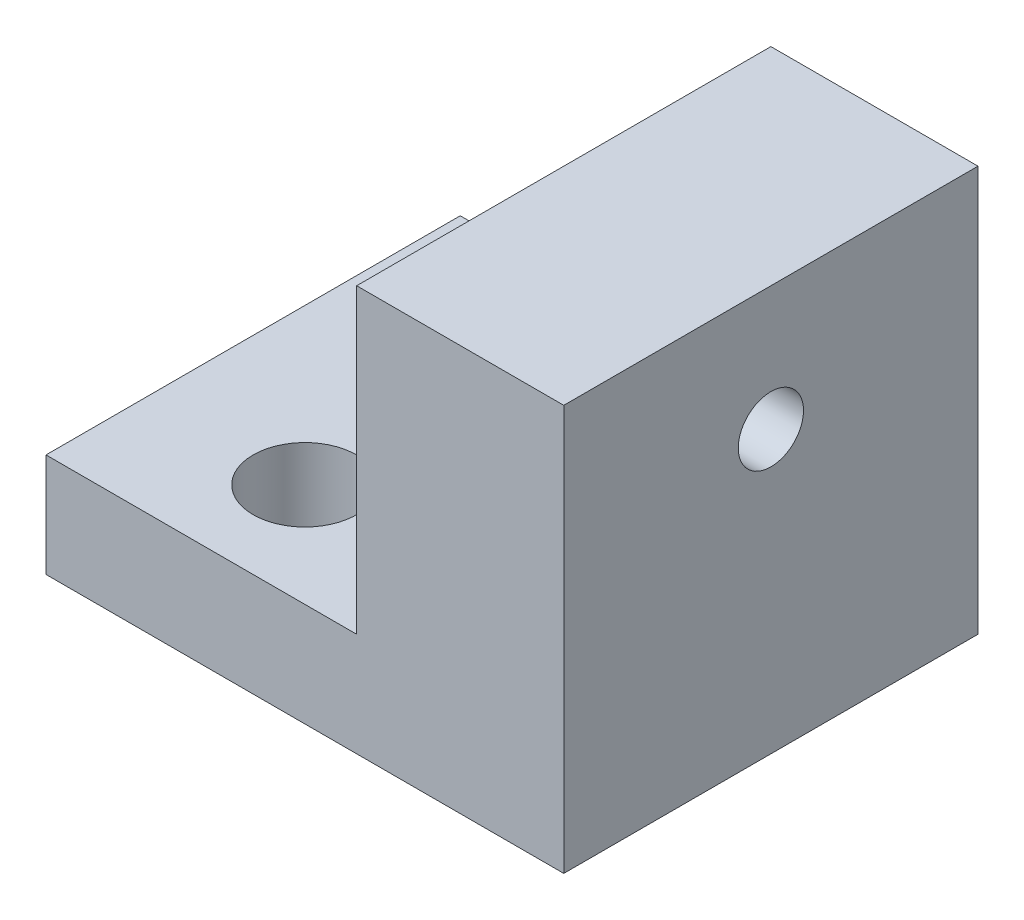
ISO-10303-21;
HEADER;
FILE_DESCRIPTION(('STEP AP214'),'2;1');
FILE_NAME('part.step','',(''),(''),'','','');
FILE_SCHEMA(('AUTOMOTIVE_DESIGN { 1 0 10303 214 1 1 1 1 }'));
ENDSEC;
DATA;
#1=APPLICATION_CONTEXT('core data for automotive mechanical design processes');
#2=APPLICATION_PROTOCOL_DEFINITION('international standard','automotive_design',2000,#1);
#3=PRODUCT_CONTEXT('',#1,'mechanical');
#4=PRODUCT('Part','Part','',(#3));
#5=PRODUCT_RELATED_PRODUCT_CATEGORY('part','',(#4));
#6=PRODUCT_DEFINITION_FORMATION('','',#4);
#7=PRODUCT_DEFINITION_CONTEXT('part definition',#1,'design');
#8=PRODUCT_DEFINITION('design','',#6,#7);
#9=PRODUCT_DEFINITION_SHAPE('','',#8);
#10=(LENGTH_UNIT() NAMED_UNIT(*) SI_UNIT(.MILLI.,.METRE.));
#11=(NAMED_UNIT(*) PLANE_ANGLE_UNIT() SI_UNIT($,.RADIAN.));
#12=(NAMED_UNIT(*) SI_UNIT($,.STERADIAN.) SOLID_ANGLE_UNIT());
#13=UNCERTAINTY_MEASURE_WITH_UNIT(LENGTH_MEASURE(1.E-05),#10,'distance_accuracy_value','');
#14=(GEOMETRIC_REPRESENTATION_CONTEXT(3) GLOBAL_UNCERTAINTY_ASSIGNED_CONTEXT((#13)) GLOBAL_UNIT_ASSIGNED_CONTEXT((#10,
#11,#12)) REPRESENTATION_CONTEXT('',''));
#15=CARTESIAN_POINT('',(0.,0.,0.));
#16=DIRECTION('',(0.,0.,1.));
#17=DIRECTION('',(1.,0.,0.));
#18=AXIS2_PLACEMENT_3D('',#15,#16,#17);
#19=CARTESIAN_POINT('',(-25.4,0.,25.4));
#20=DIRECTION('',(-1.,0.,0.));
#21=DIRECTION('',(0.,0.,1.));
#22=AXIS2_PLACEMENT_3D('',#19,#20,#21);
#23=PLANE('',#22);
#24=DIRECTION('',(0.,1.,0.));
#25=VECTOR('',#24,1.);
#26=CARTESIAN_POINT('',(-25.4,0.,0.));
#27=LINE('',#26,#25);
#28=CARTESIAN_POINT('',(-25.4,-19.05,0.));
#29=VERTEX_POINT('',#28);
#30=CARTESIAN_POINT('',(-25.4,-12.7,0.));
#31=VERTEX_POINT('',#30);
#32=EDGE_CURVE('E118',#29,#31,#27,.T.);
#33=ORIENTED_EDGE('',*,*,#32,.F.);
#34=DIRECTION('',(0.,0.,-1.));
#35=VECTOR('',#34,1.);
#36=CARTESIAN_POINT('',(-25.4,-19.05,25.4));
#37=LINE('',#36,#35);
#38=CARTESIAN_POINT('',(-25.4,-19.05,25.4));
#39=VERTEX_POINT('',#38);
#40=EDGE_CURVE('E11',#39,#29,#37,.T.);
#41=ORIENTED_EDGE('',*,*,#40,.F.);
#42=DIRECTION('',(0.,1.,0.));
#43=VECTOR('',#42,1.);
#44=CARTESIAN_POINT('',(-25.4,0.,25.4));
#45=LINE('',#44,#43);
#46=CARTESIAN_POINT('',(-25.4,-12.7,25.4));
#47=VERTEX_POINT('',#46);
#48=EDGE_CURVE('E132',#39,#47,#45,.T.);
#49=ORIENTED_EDGE('',*,*,#48,.T.);
#50=DIRECTION('',(0.,0.,-1.));
#51=VECTOR('',#50,1.);
#52=CARTESIAN_POINT('',(-25.4,-12.7,25.4));
#53=LINE('',#52,#51);
#54=EDGE_CURVE('E79',#47,#31,#53,.T.);
#55=ORIENTED_EDGE('',*,*,#54,.T.);
#56=EDGE_LOOP('',(#33,#41,#49,#55));
#57=FACE_BOUND('',#56,.T.);
#58=ADVANCED_FACE('F35',(#57),#23,.T.);
#59=CARTESIAN_POINT('',(0.,-19.05,25.4));
#60=DIRECTION('',(0.,-1.,0.));
#61=DIRECTION('',(1.,0.,0.));
#62=AXIS2_PLACEMENT_3D('',#59,#60,#61);
#63=PLANE('',#62);
#64=CARTESIAN_POINT('',(-15.875,-19.05,6.35));
#65=DIRECTION('',(0.,-1.,0.));
#66=DIRECTION('',(1.,0.,0.));
#67=AXIS2_PLACEMENT_3D('',#64,#65,#66);
#68=CIRCLE('',#67,3.175);
#69=CARTESIAN_POINT('',(-12.7,-19.05,6.35));
#70=VERTEX_POINT('',#69);
#71=EDGE_CURVE('E155',#70,#70,#68,.F.);
#72=ORIENTED_EDGE('',*,*,#71,.T.);
#73=EDGE_LOOP('',(#72));
#74=FACE_BOUND('',#73,.T.);
#75=CARTESIAN_POINT('',(-15.875,-19.05,19.05));
#76=DIRECTION('',(0.,-1.,0.));
#77=DIRECTION('',(1.,0.,0.));
#78=AXIS2_PLACEMENT_3D('',#75,#76,#77);
#79=CIRCLE('',#78,3.175);
#80=CARTESIAN_POINT('',(-12.7,-19.05,19.05));
#81=VERTEX_POINT('',#80);
#82=EDGE_CURVE('E148',#81,#81,#79,.F.);
#83=ORIENTED_EDGE('',*,*,#82,.T.);
#84=EDGE_LOOP('',(#83));
#85=FACE_BOUND('',#84,.T.);
#86=DIRECTION('',(-1.,0.,0.));
#87=VECTOR('',#86,1.);
#88=CARTESIAN_POINT('',(0.,-19.05,0.));
#89=LINE('',#88,#87);
#90=CARTESIAN_POINT('',(6.35,-19.05,0.));
#91=VERTEX_POINT('',#90);
#92=EDGE_CURVE('E121',#91,#29,#89,.T.);
#93=ORIENTED_EDGE('',*,*,#92,.F.);
#94=DIRECTION('',(0.,0.,-1.));
#95=VECTOR('',#94,1.);
#96=CARTESIAN_POINT('',(6.35,-19.05,25.4));
#97=LINE('',#96,#95);
#98=CARTESIAN_POINT('',(6.35,-19.05,25.4));
#99=VERTEX_POINT('',#98);
#100=EDGE_CURVE('E42',#99,#91,#97,.T.);
#101=ORIENTED_EDGE('',*,*,#100,.F.);
#102=DIRECTION('',(-1.,0.,0.));
#103=VECTOR('',#102,1.);
#104=CARTESIAN_POINT('',(0.,-19.05,25.4));
#105=LINE('',#104,#103);
#106=EDGE_CURVE('E114',#99,#39,#105,.T.);
#107=ORIENTED_EDGE('',*,*,#106,.T.);
#108=ORIENTED_EDGE('',*,*,#40,.T.);
#109=EDGE_LOOP('',(#93,#101,#107,#108));
#110=FACE_BOUND('',#109,.T.);
#111=ADVANCED_FACE('F142',(#74,#85,#110),#63,.T.);
#112=CARTESIAN_POINT('',(6.35,0.,25.4));
#113=DIRECTION('',(-1.,0.,0.));
#114=DIRECTION('',(0.,0.,1.));
#115=AXIS2_PLACEMENT_3D('',#112,#113,#114);
#116=PLANE('',#115);
#117=CARTESIAN_POINT('',(6.35,-1.81099996600001,12.7));
#118=DIRECTION('',(1.,0.,0.));
#119=DIRECTION('',(0.,0.,-1.));
#120=AXIS2_PLACEMENT_3D('',#117,#118,#119);
#121=CIRCLE('',#120,2.);
#122=CARTESIAN_POINT('',(6.35,-1.81099996600001,10.7));
#123=VERTEX_POINT('',#122);
#124=EDGE_CURVE('E152',#123,#123,#121,.T.);
#125=ORIENTED_EDGE('',*,*,#124,.F.);
#126=EDGE_LOOP('',(#125));
#127=FACE_BOUND('',#126,.T.);
#128=DIRECTION('',(0.,1.,0.));
#129=VECTOR('',#128,1.);
#130=CARTESIAN_POINT('',(6.35,0.,0.));
#131=LINE('',#130,#129);
#132=CARTESIAN_POINT('',(6.35,5.80900003399999,0.));
#133=VERTEX_POINT('',#132);
#134=EDGE_CURVE('E125',#91,#133,#131,.T.);
#135=ORIENTED_EDGE('',*,*,#134,.T.);
#136=DIRECTION('',(0.,0.,-1.));
#137=VECTOR('',#136,1.);
#138=CARTESIAN_POINT('',(6.35,5.80900003399999,25.4));
#139=LINE('',#138,#137);
#140=CARTESIAN_POINT('',(6.35,5.80900003399999,25.4));
#141=VERTEX_POINT('',#140);
#142=EDGE_CURVE('E49',#141,#133,#139,.T.);
#143=ORIENTED_EDGE('',*,*,#142,.F.);
#144=DIRECTION('',(0.,1.,0.));
#145=VECTOR('',#144,1.);
#146=CARTESIAN_POINT('',(6.35,0.,25.4));
#147=LINE('',#146,#145);
#148=EDGE_CURVE('E107',#99,#141,#147,.T.);
#149=ORIENTED_EDGE('',*,*,#148,.F.);
#150=ORIENTED_EDGE('',*,*,#100,.T.);
#151=EDGE_LOOP('',(#135,#143,#149,#150));
#152=FACE_BOUND('',#151,.T.);
#153=ADVANCED_FACE('F136',(#127,#152),#116,.F.);
#154=CARTESIAN_POINT('',(-6.35,0.,25.4));
#155=DIRECTION('',(-1.,0.,0.));
#156=DIRECTION('',(0.,0.,1.));
#157=AXIS2_PLACEMENT_3D('',#154,#155,#156);
#158=PLANE('',#157);
#159=DIRECTION('',(0.,0.,-1.));
#160=VECTOR('',#159,1.);
#161=CARTESIAN_POINT('',(-6.35,5.80900003399999,25.4));
#162=LINE('',#161,#160);
#163=CARTESIAN_POINT('',(-6.35,5.80900003399999,25.4));
#164=VERTEX_POINT('',#163);
#165=CARTESIAN_POINT('',(-6.35,5.80900003399999,0.));
#166=VERTEX_POINT('',#165);
#167=EDGE_CURVE('E91',#164,#166,#162,.T.);
#168=ORIENTED_EDGE('',*,*,#167,.T.);
#169=DIRECTION('',(0.,1.,0.));
#170=VECTOR('',#169,1.);
#171=CARTESIAN_POINT('',(-6.35,0.,0.));
#172=LINE('',#171,#170);
#173=CARTESIAN_POINT('',(-6.35,-12.7,0.));
#174=VERTEX_POINT('',#173);
#175=EDGE_CURVE('E128',#174,#166,#172,.T.);
#176=ORIENTED_EDGE('',*,*,#175,.F.);
#177=DIRECTION('',(0.,0.,-1.));
#178=VECTOR('',#177,1.);
#179=CARTESIAN_POINT('',(-6.35,-12.7,25.4));
#180=LINE('',#179,#178);
#181=CARTESIAN_POINT('',(-6.35,-12.7,25.4));
#182=VERTEX_POINT('',#181);
#183=EDGE_CURVE('E111',#182,#174,#180,.T.);
#184=ORIENTED_EDGE('',*,*,#183,.F.);
#185=DIRECTION('',(0.,1.,0.));
#186=VECTOR('',#185,1.);
#187=CARTESIAN_POINT('',(-6.35,0.,25.4));
#188=LINE('',#187,#186);
#189=EDGE_CURVE('E104',#182,#164,#188,.T.);
#190=ORIENTED_EDGE('',*,*,#189,.T.);
#191=EDGE_LOOP('',(#168,#176,#184,#190));
#192=FACE_BOUND('',#191,.T.);
#193=CARTESIAN_POINT('',(-6.35,-1.81099996600001,12.7));
#194=DIRECTION('',(-1.,0.,0.));
#195=DIRECTION('',(0.,0.,1.));
#196=AXIS2_PLACEMENT_3D('',#193,#194,#195);
#197=CIRCLE('',#196,2.);
#198=CARTESIAN_POINT('',(-6.35,-1.81099996600001,14.7));
#199=VERTEX_POINT('',#198);
#200=EDGE_CURVE('E100',#199,#199,#197,.F.);
#201=ORIENTED_EDGE('',*,*,#200,.T.);
#202=EDGE_LOOP('',(#201));
#203=FACE_BOUND('',#202,.T.);
#204=ADVANCED_FACE('F109',(#192,#203),#158,.T.);
#205=CARTESIAN_POINT('',(0.,-12.7,25.4));
#206=DIRECTION('',(0.,-1.,0.));
#207=DIRECTION('',(1.,0.,0.));
#208=AXIS2_PLACEMENT_3D('',#205,#206,#207);
#209=PLANE('',#208);
#210=CARTESIAN_POINT('',(-15.875,-12.7,6.35));
#211=DIRECTION('',(0.,1.,0.));
#212=DIRECTION('',(-1.,0.,0.));
#213=AXIS2_PLACEMENT_3D('',#210,#211,#212);
#214=CIRCLE('',#213,3.175);
#215=CARTESIAN_POINT('',(-19.05,-12.7,6.35));
#216=VERTEX_POINT('',#215);
#217=EDGE_CURVE('E122',#216,#216,#214,.T.);
#218=ORIENTED_EDGE('',*,*,#217,.F.);
#219=EDGE_LOOP('',(#218));
#220=FACE_BOUND('',#219,.T.);
#221=CARTESIAN_POINT('',(-15.875,-12.7,19.05));
#222=DIRECTION('',(0.,1.,0.));
#223=DIRECTION('',(-1.,0.,0.));
#224=AXIS2_PLACEMENT_3D('',#221,#222,#223);
#225=CIRCLE('',#224,3.175);
#226=CARTESIAN_POINT('',(-19.05,-12.7,19.05));
#227=VERTEX_POINT('',#226);
#228=EDGE_CURVE('E151',#227,#227,#225,.T.);
#229=ORIENTED_EDGE('',*,*,#228,.F.);
#230=EDGE_LOOP('',(#229));
#231=FACE_BOUND('',#230,.T.);
#232=DIRECTION('',(-1.,0.,0.));
#233=VECTOR('',#232,1.);
#234=CARTESIAN_POINT('',(0.,-12.7,0.));
#235=LINE('',#234,#233);
#236=EDGE_CURVE('E130',#174,#31,#235,.T.);
#237=ORIENTED_EDGE('',*,*,#236,.T.);
#238=ORIENTED_EDGE('',*,*,#54,.F.);
#239=DIRECTION('',(-1.,0.,0.));
#240=VECTOR('',#239,1.);
#241=CARTESIAN_POINT('',(0.,-12.7,25.4));
#242=LINE('',#241,#240);
#243=EDGE_CURVE('E58',#182,#47,#242,.T.);
#244=ORIENTED_EDGE('',*,*,#243,.F.);
#245=ORIENTED_EDGE('',*,*,#183,.T.);
#246=EDGE_LOOP('',(#237,#238,#244,#245));
#247=FACE_BOUND('',#246,.T.);
#248=ADVANCED_FACE('F145',(#220,#231,#247),#209,.F.);
#249=CARTESIAN_POINT('',(0.,0.,25.4));
#250=DIRECTION('',(0.,0.,1.));
#251=DIRECTION('',(1.,0.,0.));
#252=AXIS2_PLACEMENT_3D('',#249,#250,#251);
#253=PLANE('',#252);
#254=DIRECTION('',(1.,0.,0.));
#255=VECTOR('',#254,1.);
#256=CARTESIAN_POINT('',(-25.401,5.80900003399999,25.4));
#257=LINE('',#256,#255);
#258=EDGE_CURVE('E94',#164,#141,#257,.T.);
#259=ORIENTED_EDGE('',*,*,#258,.F.);
#260=ORIENTED_EDGE('',*,*,#189,.F.);
#261=ORIENTED_EDGE('',*,*,#243,.T.);
#262=ORIENTED_EDGE('',*,*,#48,.F.);
#263=ORIENTED_EDGE('',*,*,#106,.F.);
#264=ORIENTED_EDGE('',*,*,#148,.T.);
#265=EDGE_LOOP('',(#259,#260,#261,#262,#263,#264));
#266=FACE_BOUND('',#265,.T.);
#267=ADVANCED_FACE('F103',(#266),#253,.T.);
#268=CARTESIAN_POINT('',(0.,0.,0.));
#269=DIRECTION('',(0.,0.,1.));
#270=DIRECTION('',(1.,0.,0.));
#271=AXIS2_PLACEMENT_3D('',#268,#269,#270);
#272=PLANE('',#271);
#273=ORIENTED_EDGE('',*,*,#175,.T.);
#274=DIRECTION('',(1.,0.,0.));
#275=VECTOR('',#274,1.);
#276=CARTESIAN_POINT('',(-25.401,5.80900003399999,0.));
#277=LINE('',#276,#275);
#278=EDGE_CURVE('E95',#166,#133,#277,.T.);
#279=ORIENTED_EDGE('',*,*,#278,.T.);
#280=ORIENTED_EDGE('',*,*,#134,.F.);
#281=ORIENTED_EDGE('',*,*,#92,.T.);
#282=ORIENTED_EDGE('',*,*,#32,.T.);
#283=ORIENTED_EDGE('',*,*,#236,.F.);
#284=EDGE_LOOP('',(#273,#279,#280,#281,#282,#283));
#285=FACE_BOUND('',#284,.T.);
#286=ADVANCED_FACE('F141',(#285),#272,.F.);
#287=CARTESIAN_POINT('',(-15.875,-19.051,19.05));
#288=DIRECTION('',(0.,1.,0.));
#289=DIRECTION('',(-1.,0.,0.));
#290=AXIS2_PLACEMENT_3D('',#287,#288,#289);
#291=CYLINDRICAL_SURFACE('',#290,3.175);
#292=ORIENTED_EDGE('',*,*,#82,.F.);
#293=EDGE_LOOP('',(#292));
#294=FACE_BOUND('',#293,.T.);
#295=ORIENTED_EDGE('',*,*,#228,.T.);
#296=EDGE_LOOP('',(#295));
#297=FACE_BOUND('',#296,.T.);
#298=ADVANCED_FACE('F203',(#294,#297),#291,.F.);
#299=CARTESIAN_POINT('',(-15.875,-19.051,6.35));
#300=DIRECTION('',(0.,1.,0.));
#301=DIRECTION('',(-1.,0.,0.));
#302=AXIS2_PLACEMENT_3D('',#299,#300,#301);
#303=CYLINDRICAL_SURFACE('',#302,3.175);
#304=ORIENTED_EDGE('',*,*,#71,.F.);
#305=EDGE_LOOP('',(#304));
#306=FACE_BOUND('',#305,.T.);
#307=ORIENTED_EDGE('',*,*,#217,.T.);
#308=EDGE_LOOP('',(#307));
#309=FACE_BOUND('',#308,.T.);
#310=ADVANCED_FACE('F208',(#306,#309),#303,.F.);
#311=CARTESIAN_POINT('',(-25.401,-1.81099996600001,12.7));
#312=DIRECTION('',(1.,0.,0.));
#313=DIRECTION('',(0.,0.,-1.));
#314=AXIS2_PLACEMENT_3D('',#311,#312,#313);
#315=CYLINDRICAL_SURFACE('',#314,2.);
#316=ORIENTED_EDGE('',*,*,#200,.F.);
#317=EDGE_LOOP('',(#316));
#318=FACE_BOUND('',#317,.T.);
#319=ORIENTED_EDGE('',*,*,#124,.T.);
#320=EDGE_LOOP('',(#319));
#321=FACE_BOUND('',#320,.T.);
#322=ADVANCED_FACE('F167',(#318,#321),#315,.F.);
#323=CARTESIAN_POINT('',(-25.401,5.80900003399999,25.4));
#324=DIRECTION('',(0.,-1.,0.));
#325=DIRECTION('',(0.,0.,-1.));
#326=AXIS2_PLACEMENT_3D('',#323,#324,#325);
#327=PLANE('',#326);
#328=ORIENTED_EDGE('',*,*,#258,.T.);
#329=ORIENTED_EDGE('',*,*,#142,.T.);
#330=ORIENTED_EDGE('',*,*,#278,.F.);
#331=ORIENTED_EDGE('',*,*,#167,.F.);
#332=EDGE_LOOP('',(#328,#329,#330,#331));
#333=FACE_BOUND('',#332,.T.);
#334=ADVANCED_FACE('F93',(#333),#327,.F.);
#335=CLOSED_SHELL('',(#58,#111,#153,#204,#248,#267,#286,#298,#310,#322,#334));
#336=MANIFOLD_SOLID_BREP('B2',#335);
#337=ADVANCED_BREP_SHAPE_REPRESENTATION('',(#18,#336),#14);
#338=SHAPE_DEFINITION_REPRESENTATION(#9,#337);
ENDSEC;
END-ISO-10303-21;
